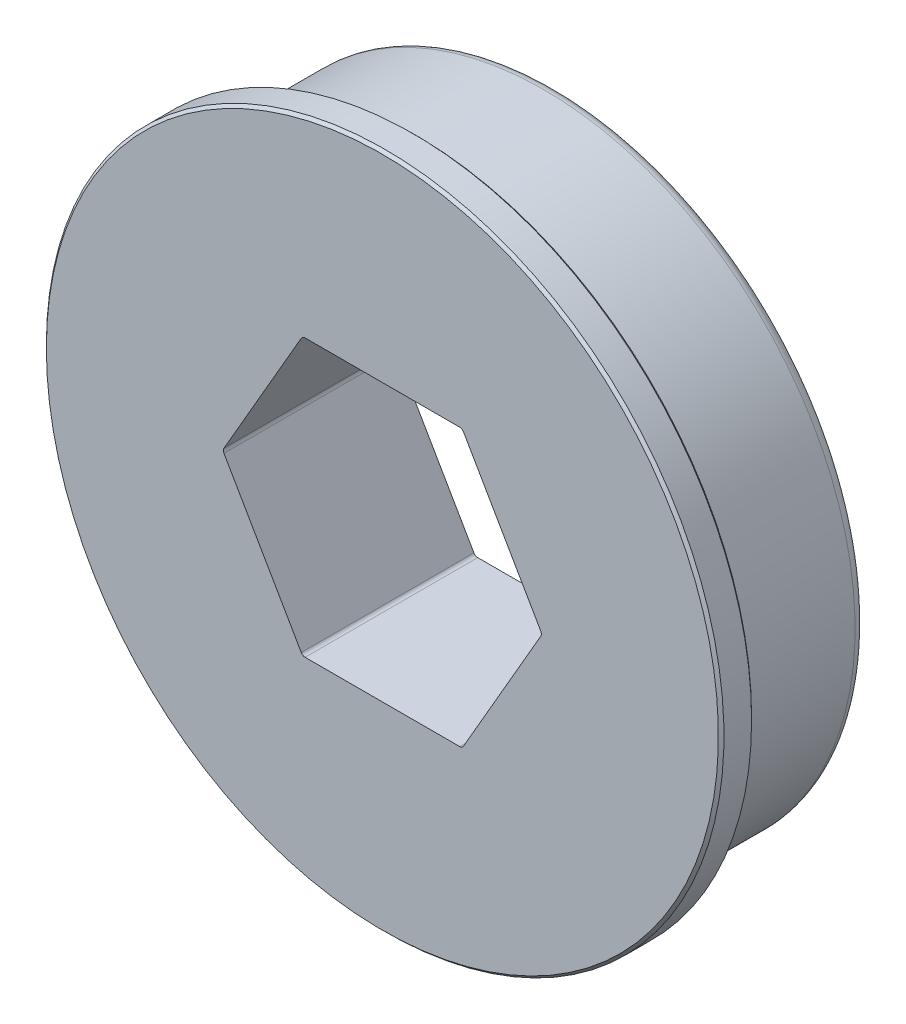
ISO-10303-21;
HEADER;
FILE_DESCRIPTION(('STEP AP214'),'2;1');
FILE_NAME('part.step','',(''),(''),'','','');
FILE_SCHEMA(('AUTOMOTIVE_DESIGN { 1 0 10303 214 1 1 1 1 }'));
ENDSEC;
DATA;
#1=APPLICATION_CONTEXT('core data for automotive mechanical design processes');
#2=APPLICATION_PROTOCOL_DEFINITION('international standard','automotive_design',2000,#1);
#3=PRODUCT_CONTEXT('',#1,'mechanical');
#4=PRODUCT('Part','Part','',(#3));
#5=PRODUCT_RELATED_PRODUCT_CATEGORY('part','',(#4));
#6=PRODUCT_DEFINITION_FORMATION('','',#4);
#7=PRODUCT_DEFINITION_CONTEXT('part definition',#1,'design');
#8=PRODUCT_DEFINITION('design','',#6,#7);
#9=PRODUCT_DEFINITION_SHAPE('','',#8);
#10=(LENGTH_UNIT() NAMED_UNIT(*) SI_UNIT(.MILLI.,.METRE.));
#11=(NAMED_UNIT(*) PLANE_ANGLE_UNIT() SI_UNIT($,.RADIAN.));
#12=(NAMED_UNIT(*) SI_UNIT($,.STERADIAN.) SOLID_ANGLE_UNIT());
#13=UNCERTAINTY_MEASURE_WITH_UNIT(LENGTH_MEASURE(1.E-05),#10,'distance_accuracy_value','');
#14=(GEOMETRIC_REPRESENTATION_CONTEXT(3) GLOBAL_UNCERTAINTY_ASSIGNED_CONTEXT((#13)) GLOBAL_UNIT_ASSIGNED_CONTEXT((#10,
#11,#12)) REPRESENTATION_CONTEXT('',''));
#15=CARTESIAN_POINT('',(0.,0.,0.));
#16=DIRECTION('',(0.,0.,1.));
#17=DIRECTION('',(1.,0.,0.));
#18=AXIS2_PLACEMENT_3D('',#15,#16,#17);
#19=CARTESIAN_POINT('',(0.,0.,7.92734));
#20=DIRECTION('',(0.,0.,-1.));
#21=DIRECTION('',(-1.,0.,0.));
#22=AXIS2_PLACEMENT_3D('',#19,#20,#21);
#23=CYLINDRICAL_SURFACE('',#22,13.97);
#24=CARTESIAN_POINT('',(0.,0.,6.40333999999999));
#25=DIRECTION('',(0.,0.,-1.));
#26=DIRECTION('',(-1.,0.,0.));
#27=AXIS2_PLACEMENT_3D('',#24,#25,#26);
#28=CIRCLE('',#27,13.97);
#29=CARTESIAN_POINT('',(-13.97,0.,6.40333999999999));
#30=VERTEX_POINT('',#29);
#31=EDGE_CURVE('E308',#30,#30,#28,.F.);
#32=ORIENTED_EDGE('',*,*,#31,.F.);
#33=EDGE_LOOP('',(#32));
#34=FACE_BOUND('',#33,.T.);
#35=CARTESIAN_POINT('',(0.,0.,5.89534));
#36=DIRECTION('',(0.,0.,-1.));
#37=DIRECTION('',(-1.,0.,0.));
#38=AXIS2_PLACEMENT_3D('',#35,#36,#37);
#39=CIRCLE('',#38,13.97);
#40=CARTESIAN_POINT('',(-13.97,0.,5.89534));
#41=VERTEX_POINT('',#40);
#42=EDGE_CURVE('E312',#41,#41,#39,.T.);
#43=ORIENTED_EDGE('',*,*,#42,.F.);
#44=EDGE_LOOP('',(#43));
#45=FACE_BOUND('',#44,.T.);
#46=ADVANCED_FACE('F16',(#34,#45),#23,.T.);
#47=CARTESIAN_POINT('',(14.2875,0.,5.89534));
#48=DIRECTION('',(0.,0.,1.));
#49=DIRECTION('',(1.,0.,0.));
#50=AXIS2_PLACEMENT_3D('',#47,#48,#49);
#51=PLANE('',#50);
#52=CARTESIAN_POINT('',(0.,0.,5.89534));
#53=DIRECTION('',(0.,0.,-1.));
#54=DIRECTION('',(-1.,0.,0.));
#55=AXIS2_PLACEMENT_3D('',#52,#53,#54);
#56=CIRCLE('',#55,14.2875);
#57=CARTESIAN_POINT('',(-14.2875,0.,5.89534));
#58=VERTEX_POINT('',#57);
#59=EDGE_CURVE('E304',#58,#58,#56,.T.);
#60=ORIENTED_EDGE('',*,*,#59,.F.);
#61=EDGE_LOOP('',(#60));
#62=FACE_BOUND('',#61,.T.);
#63=ORIENTED_EDGE('',*,*,#42,.T.);
#64=EDGE_LOOP('',(#63));
#65=FACE_BOUND('',#64,.T.);
#66=ADVANCED_FACE('F449',(#62,#65),#51,.T.);
#67=CARTESIAN_POINT('',(13.97,0.,6.40334));
#68=DIRECTION('',(0.,0.,-1.));
#69=DIRECTION('',(-1.,0.,0.));
#70=AXIS2_PLACEMENT_3D('',#67,#68,#69);
#71=PLANE('',#70);
#72=ORIENTED_EDGE('',*,*,#31,.T.);
#73=EDGE_LOOP('',(#72));
#74=FACE_BOUND('',#73,.T.);
#75=CARTESIAN_POINT('',(0.,0.,6.40334));
#76=DIRECTION('',(0.,0.,1.));
#77=DIRECTION('',(1.,0.,0.));
#78=AXIS2_PLACEMENT_3D('',#75,#76,#77);
#79=CIRCLE('',#78,15.4305);
#80=CARTESIAN_POINT('',(15.4305,0.,6.40334));
#81=VERTEX_POINT('',#80);
#82=EDGE_CURVE('E262',#81,#81,#79,.T.);
#83=ORIENTED_EDGE('',*,*,#82,.F.);
#84=EDGE_LOOP('',(#83));
#85=FACE_BOUND('',#84,.T.);
#86=ADVANCED_FACE('F447',(#74,#85),#71,.T.);
#87=CARTESIAN_POINT('',(0.,0.,7.92734));
#88=DIRECTION('',(0.,0.,-1.));
#89=DIRECTION('',(-1.,0.,0.));
#90=AXIS2_PLACEMENT_3D('',#87,#88,#89);
#91=CYLINDRICAL_SURFACE('',#90,14.2875);
#92=ORIENTED_EDGE('',*,*,#59,.T.);
#93=EDGE_LOOP('',(#92));
#94=FACE_BOUND('',#93,.T.);
#95=CARTESIAN_POINT('',(0.,0.,0.508));
#96=DIRECTION('',(0.,0.,-1.));
#97=DIRECTION('',(-1.,0.,0.));
#98=AXIS2_PLACEMENT_3D('',#95,#96,#97);
#99=CIRCLE('',#98,14.2875);
#100=CARTESIAN_POINT('',(-14.2875,0.,0.508));
#101=VERTEX_POINT('',#100);
#102=EDGE_CURVE('E258',#101,#101,#99,.T.);
#103=ORIENTED_EDGE('',*,*,#102,.F.);
#104=EDGE_LOOP('',(#103));
#105=FACE_BOUND('',#104,.T.);
#106=ADVANCED_FACE('F444',(#94,#105),#91,.T.);
#107=CARTESIAN_POINT('',(0.,0.,6.53034000000001));
#108=DIRECTION('',(0.,0.,1.));
#109=DIRECTION('',(1.,0.,0.));
#110=AXIS2_PLACEMENT_3D('',#107,#108,#109);
#111=CONICAL_SURFACE('',#110,15.5575,0.785398163397465);
#112=CARTESIAN_POINT('',(0.,0.,6.53034000000001));
#113=DIRECTION('',(0.,0.,-1.));
#114=DIRECTION('',(-1.,0.,0.));
#115=AXIS2_PLACEMENT_3D('',#112,#113,#114);
#116=CIRCLE('',#115,15.5575);
#117=CARTESIAN_POINT('',(-15.5575,0.,6.53034000000001));
#118=VERTEX_POINT('',#117);
#119=EDGE_CURVE('E98',#118,#118,#116,.F.);
#120=ORIENTED_EDGE('',*,*,#119,.F.);
#121=EDGE_LOOP('',(#120));
#122=FACE_BOUND('',#121,.T.);
#123=ORIENTED_EDGE('',*,*,#82,.T.);
#124=EDGE_LOOP('',(#123));
#125=FACE_BOUND('',#124,.T.);
#126=ADVANCED_FACE('F242',(#122,#125),#111,.T.);
#127=CARTESIAN_POINT('',(0.,0.,0.508));
#128=DIRECTION('',(0.,0.,-1.));
#129=DIRECTION('',(-1.,0.,0.));
#130=AXIS2_PLACEMENT_3D('',#127,#128,#129);
#131=TOROIDAL_SURFACE('',#130,13.7795,0.508);
#132=ORIENTED_EDGE('',*,*,#102,.T.);
#133=EDGE_LOOP('',(#132));
#134=FACE_BOUND('',#133,.T.);
#135=CARTESIAN_POINT('',(0.,0.,0.));
#136=DIRECTION('',(0.,0.,1.));
#137=DIRECTION('',(-1.,0.,0.));
#138=AXIS2_PLACEMENT_3D('',#135,#136,#137);
#139=CIRCLE('',#138,13.7795);
#140=CARTESIAN_POINT('',(13.7795,0.,0.));
#141=VERTEX_POINT('',#140);
#142=CARTESIAN_POINT('',(-13.7795,0.,0.));
#143=VERTEX_POINT('',#142);
#144=EDGE_CURVE('E290',#141,#143,#139,.F.);
#145=ORIENTED_EDGE('',*,*,#144,.F.);
#146=CARTESIAN_POINT('',(0.,0.,0.));
#147=DIRECTION('',(0.,0.,1.));
#148=DIRECTION('',(1.,0.,0.));
#149=AXIS2_PLACEMENT_3D('',#146,#147,#148);
#150=CIRCLE('',#149,13.7795);
#151=EDGE_CURVE('E184',#143,#141,#150,.F.);
#152=ORIENTED_EDGE('',*,*,#151,.F.);
#153=EDGE_LOOP('',(#145,#152));
#154=FACE_BOUND('',#153,.T.);
#155=ADVANCED_FACE('F236',(#134,#154),#131,.T.);
#156=CARTESIAN_POINT('',(0.,0.,7.92734));
#157=DIRECTION('',(0.,0.,-1.));
#158=DIRECTION('',(-1.,0.,0.));
#159=AXIS2_PLACEMENT_3D('',#156,#157,#158);
#160=CYLINDRICAL_SURFACE('',#159,15.5575);
#161=ORIENTED_EDGE('',*,*,#119,.T.);
#162=EDGE_LOOP('',(#161));
#163=FACE_BOUND('',#162,.T.);
#164=CARTESIAN_POINT('',(0.,0.,7.80034));
#165=DIRECTION('',(0.,0.,-1.));
#166=DIRECTION('',(-1.,0.,0.));
#167=AXIS2_PLACEMENT_3D('',#164,#165,#166);
#168=CIRCLE('',#167,15.5575);
#169=CARTESIAN_POINT('',(-15.5575,0.,7.80034));
#170=VERTEX_POINT('',#169);
#171=EDGE_CURVE('E174',#170,#170,#168,.F.);
#172=ORIENTED_EDGE('',*,*,#171,.F.);
#173=EDGE_LOOP('',(#172));
#174=FACE_BOUND('',#173,.T.);
#175=ADVANCED_FACE('F241',(#163,#174),#160,.T.);
#176=CARTESIAN_POINT('',(-7.09771326930958,0.,7.92734));
#177=DIRECTION('',(0.,0.,1.));
#178=DIRECTION('',(1.,0.,0.));
#179=AXIS2_PLACEMENT_3D('',#176,#177,#178);
#180=CYLINDRICAL_SURFACE('',#179,0.2032);
#181=DIRECTION('',(0.,0.,1.));
#182=VECTOR('',#181,1.);
#183=CARTESIAN_POINT('',(-7.27368963135858,-0.101600000000005,7.92734));
#184=LINE('',#183,#182);
#185=CARTESIAN_POINT('',(-7.27368963135857,-0.101600000000006,7.92734));
#186=VERTEX_POINT('',#185);
#187=CARTESIAN_POINT('',(-7.27368963135857,-0.101600000000005,0.));
#188=VERTEX_POINT('',#187);
#189=EDGE_CURVE('E171',#186,#188,#184,.F.);
#190=ORIENTED_EDGE('',*,*,#189,.T.);
#191=CARTESIAN_POINT('',(-7.09771326930958,0.,0.));
#192=DIRECTION('',(0.,0.,1.));
#193=DIRECTION('',(1.,0.,0.));
#194=AXIS2_PLACEMENT_3D('',#191,#192,#193);
#195=CIRCLE('',#194,0.2032);
#196=CARTESIAN_POINT('',(-7.27368963135857,0.101599999999994,0.));
#197=VERTEX_POINT('',#196);
#198=EDGE_CURVE('E106',#197,#188,#195,.T.);
#199=ORIENTED_EDGE('',*,*,#198,.F.);
#200=DIRECTION('',(0.,0.,1.));
#201=VECTOR('',#200,1.);
#202=CARTESIAN_POINT('',(-7.27368963135857,0.101599999999993,7.92734));
#203=LINE('',#202,#201);
#204=CARTESIAN_POINT('',(-7.27368963135857,0.101599999999994,7.92734));
#205=VERTEX_POINT('',#204);
#206=EDGE_CURVE('E102',#197,#205,#203,.T.);
#207=ORIENTED_EDGE('',*,*,#206,.T.);
#208=CARTESIAN_POINT('',(-7.09771326930958,0.,7.92734));
#209=DIRECTION('',(0.,0.,1.));
#210=DIRECTION('',(1.,0.,0.));
#211=AXIS2_PLACEMENT_3D('',#208,#209,#210);
#212=CIRCLE('',#211,0.2032);
#213=EDGE_CURVE('E85',#186,#205,#212,.F.);
#214=ORIENTED_EDGE('',*,*,#213,.F.);
#215=EDGE_LOOP('',(#190,#199,#207,#214));
#216=FACE_BOUND('',#215,.T.);
#217=ADVANCED_FACE('F103',(#216),#180,.F.);
#218=CARTESIAN_POINT('',(-3.54885663465479,6.14679999999999,7.92734));
#219=DIRECTION('',(0.,0.,1.));
#220=DIRECTION('',(1.,0.,0.));
#221=AXIS2_PLACEMENT_3D('',#218,#219,#220);
#222=CYLINDRICAL_SURFACE('',#221,0.2032);
#223=DIRECTION('',(0.,0.,1.));
#224=VECTOR('',#223,1.);
#225=CARTESIAN_POINT('',(-3.72483299670379,6.24839999999999,7.92734));
#226=LINE('',#225,#224);
#227=CARTESIAN_POINT('',(-3.72483299670379,6.24839999999999,7.92734));
#228=VERTEX_POINT('',#227);
#229=CARTESIAN_POINT('',(-3.72483299670378,6.24839999999999,0.));
#230=VERTEX_POINT('',#229);
#231=EDGE_CURVE('E117',#228,#230,#226,.F.);
#232=ORIENTED_EDGE('',*,*,#231,.T.);
#233=CARTESIAN_POINT('',(-3.54885663465479,6.14679999999999,0.));
#234=DIRECTION('',(0.,0.,1.));
#235=DIRECTION('',(1.,0.,0.));
#236=AXIS2_PLACEMENT_3D('',#233,#234,#235);
#237=CIRCLE('',#236,0.2032);
#238=CARTESIAN_POINT('',(-3.54885663465479,6.34999999999999,0.));
#239=VERTEX_POINT('',#238);
#240=EDGE_CURVE('E272',#239,#230,#237,.T.);
#241=ORIENTED_EDGE('',*,*,#240,.F.);
#242=DIRECTION('',(0.,0.,1.));
#243=VECTOR('',#242,1.);
#244=CARTESIAN_POINT('',(-3.54885663465479,6.34999999999999,7.92734));
#245=LINE('',#244,#243);
#246=CARTESIAN_POINT('',(-3.54885663465479,6.34999999999999,7.92734));
#247=VERTEX_POINT('',#246);
#248=EDGE_CURVE('E111',#239,#247,#245,.T.);
#249=ORIENTED_EDGE('',*,*,#248,.T.);
#250=CARTESIAN_POINT('',(-3.54885663465479,6.14679999999999,7.92734));
#251=DIRECTION('',(0.,0.,1.));
#252=DIRECTION('',(1.,0.,0.));
#253=AXIS2_PLACEMENT_3D('',#250,#251,#252);
#254=CIRCLE('',#253,0.2032);
#255=EDGE_CURVE('E97',#228,#247,#254,.F.);
#256=ORIENTED_EDGE('',*,*,#255,.F.);
#257=EDGE_LOOP('',(#232,#241,#249,#256));
#258=FACE_BOUND('',#257,.T.);
#259=ADVANCED_FACE('F387',(#258),#222,.F.);
#260=CARTESIAN_POINT('',(3.5488566346548,6.1468,7.92734));
#261=DIRECTION('',(0.,0.,1.));
#262=DIRECTION('',(1.,0.,0.));
#263=AXIS2_PLACEMENT_3D('',#260,#261,#262);
#264=CYLINDRICAL_SURFACE('',#263,0.2032);
#265=DIRECTION('',(0.,0.,1.));
#266=VECTOR('',#265,1.);
#267=CARTESIAN_POINT('',(3.5488566346548,6.35,7.92734));
#268=LINE('',#267,#266);
#269=CARTESIAN_POINT('',(3.5488566346548,6.34999999999999,7.92734));
#270=VERTEX_POINT('',#269);
#271=CARTESIAN_POINT('',(3.5488566346548,6.35,0.));
#272=VERTEX_POINT('',#271);
#273=EDGE_CURVE('E162',#270,#272,#268,.F.);
#274=ORIENTED_EDGE('',*,*,#273,.T.);
#275=CARTESIAN_POINT('',(3.5488566346548,6.1468,0.));
#276=DIRECTION('',(0.,0.,1.));
#277=DIRECTION('',(1.,0.,0.));
#278=AXIS2_PLACEMENT_3D('',#275,#276,#277);
#279=CIRCLE('',#278,0.2032);
#280=CARTESIAN_POINT('',(3.7248329967038,6.2484,0.));
#281=VERTEX_POINT('',#280);
#282=EDGE_CURVE('E276',#281,#272,#279,.T.);
#283=ORIENTED_EDGE('',*,*,#282,.F.);
#284=DIRECTION('',(0.,0.,1.));
#285=VECTOR('',#284,1.);
#286=CARTESIAN_POINT('',(3.72483299670379,6.2484,7.92734));
#287=LINE('',#286,#285);
#288=CARTESIAN_POINT('',(3.72483299670379,6.2484,7.92734));
#289=VERTEX_POINT('',#288);
#290=EDGE_CURVE('E149',#281,#289,#287,.T.);
#291=ORIENTED_EDGE('',*,*,#290,.T.);
#292=CARTESIAN_POINT('',(3.5488566346548,6.1468,7.92734));
#293=DIRECTION('',(0.,0.,1.));
#294=DIRECTION('',(1.,0.,0.));
#295=AXIS2_PLACEMENT_3D('',#292,#293,#294);
#296=CIRCLE('',#295,0.2032);
#297=EDGE_CURVE('E296',#270,#289,#296,.F.);
#298=ORIENTED_EDGE('',*,*,#297,.F.);
#299=EDGE_LOOP('',(#274,#283,#291,#298));
#300=FACE_BOUND('',#299,.T.);
#301=ADVANCED_FACE('F393',(#300),#264,.F.);
#302=CARTESIAN_POINT('',(7.09771326930959,0.,7.92734));
#303=DIRECTION('',(0.,0.,1.));
#304=DIRECTION('',(1.,0.,0.));
#305=AXIS2_PLACEMENT_3D('',#302,#303,#304);
#306=CYLINDRICAL_SURFACE('',#305,0.2032);
#307=CARTESIAN_POINT('',(7.09771326930959,0.,0.));
#308=DIRECTION('',(0.,0.,1.));
#309=DIRECTION('',(1.,0.,0.));
#310=AXIS2_PLACEMENT_3D('',#307,#308,#309);
#311=CIRCLE('',#310,0.2032);
#312=CARTESIAN_POINT('',(7.27368963135859,-0.101600000000005,0.));
#313=VERTEX_POINT('',#312);
#314=CARTESIAN_POINT('',(7.27368963135859,0.101599999999995,0.));
#315=VERTEX_POINT('',#314);
#316=EDGE_CURVE('E280',#313,#315,#311,.T.);
#317=ORIENTED_EDGE('',*,*,#316,.F.);
#318=DIRECTION('',(0.,0.,1.));
#319=VECTOR('',#318,1.);
#320=CARTESIAN_POINT('',(7.27368963135859,-0.101600000000005,7.92734));
#321=LINE('',#320,#319);
#322=CARTESIAN_POINT('',(7.27368963135859,-0.101600000000005,7.92734));
#323=VERTEX_POINT('',#322);
#324=EDGE_CURVE('E140',#313,#323,#321,.T.);
#325=ORIENTED_EDGE('',*,*,#324,.T.);
#326=CARTESIAN_POINT('',(7.09771326930959,0.,7.92734));
#327=DIRECTION('',(0.,0.,1.));
#328=DIRECTION('',(1.,0.,0.));
#329=AXIS2_PLACEMENT_3D('',#326,#327,#328);
#330=CIRCLE('',#329,0.2032);
#331=CARTESIAN_POINT('',(7.27368963135859,0.101599999999995,7.92734));
#332=VERTEX_POINT('',#331);
#333=EDGE_CURVE('E293',#332,#323,#330,.F.);
#334=ORIENTED_EDGE('',*,*,#333,.F.);
#335=DIRECTION('',(0.,0.,1.));
#336=VECTOR('',#335,1.);
#337=CARTESIAN_POINT('',(7.27368963135859,0.101599999999995,7.92734));
#338=LINE('',#337,#336);
#339=EDGE_CURVE('E154',#332,#315,#338,.F.);
#340=ORIENTED_EDGE('',*,*,#339,.T.);
#341=EDGE_LOOP('',(#317,#325,#334,#340));
#342=FACE_BOUND('',#341,.T.);
#343=ADVANCED_FACE('F401',(#342),#306,.F.);
#344=CARTESIAN_POINT('',(-3.54885663465478,-6.14680000000001,7.92734));
#345=DIRECTION('',(0.,0.,1.));
#346=DIRECTION('',(1.,0.,0.));
#347=AXIS2_PLACEMENT_3D('',#344,#345,#346);
#348=CYLINDRICAL_SURFACE('',#347,0.2032);
#349=DIRECTION('',(0.,0.,-1.));
#350=VECTOR('',#349,1.);
#351=CARTESIAN_POINT('',(-3.54885663465478,-6.35000000000001,7.92734));
#352=LINE('',#351,#350);
#353=CARTESIAN_POINT('',(-3.54885663465478,-6.35000000000001,7.92734));
#354=VERTEX_POINT('',#353);
#355=CARTESIAN_POINT('',(-3.54885663465478,-6.35000000000001,0.));
#356=VERTEX_POINT('',#355);
#357=EDGE_CURVE('E137',#354,#356,#352,.T.);
#358=ORIENTED_EDGE('',*,*,#357,.T.);
#359=CARTESIAN_POINT('',(-3.54885663465478,-6.14680000000001,0.));
#360=DIRECTION('',(0.,0.,1.));
#361=DIRECTION('',(1.,0.,0.));
#362=AXIS2_PLACEMENT_3D('',#359,#360,#361);
#363=CIRCLE('',#362,0.2032);
#364=CARTESIAN_POINT('',(-3.72483299670378,-6.24840000000001,0.));
#365=VERTEX_POINT('',#364);
#366=EDGE_CURVE('E284',#365,#356,#363,.T.);
#367=ORIENTED_EDGE('',*,*,#366,.F.);
#368=DIRECTION('',(0.,0.,1.));
#369=VECTOR('',#368,1.);
#370=CARTESIAN_POINT('',(-3.72483299670378,-6.24840000000001,7.92734));
#371=LINE('',#370,#369);
#372=CARTESIAN_POINT('',(-3.72483299670378,-6.24840000000001,7.92734));
#373=VERTEX_POINT('',#372);
#374=EDGE_CURVE('E167',#365,#373,#371,.T.);
#375=ORIENTED_EDGE('',*,*,#374,.T.);
#376=CARTESIAN_POINT('',(-3.54885663465478,-6.14680000000001,7.92734));
#377=DIRECTION('',(0.,0.,1.));
#378=DIRECTION('',(1.,0.,0.));
#379=AXIS2_PLACEMENT_3D('',#376,#377,#378);
#380=CIRCLE('',#379,0.2032);
#381=EDGE_CURVE('E41',#354,#373,#380,.F.);
#382=ORIENTED_EDGE('',*,*,#381,.F.);
#383=EDGE_LOOP('',(#358,#367,#375,#382));
#384=FACE_BOUND('',#383,.T.);
#385=ADVANCED_FACE('F201',(#384),#348,.F.);
#386=CARTESIAN_POINT('',(0.,0.,0.));
#387=DIRECTION('',(0.,0.,-1.));
#388=DIRECTION('',(-1.,0.,0.));
#389=AXIS2_PLACEMENT_3D('',#386,#387,#388);
#390=PLANE('',#389);
#391=DIRECTION('',(-1.,0.,0.));
#392=VECTOR('',#391,1.);
#393=CARTESIAN_POINT('',(-3.66617420935412,6.34999999999999,0.));
#394=LINE('',#393,#392);
#395=EDGE_CURVE('E158',#272,#239,#394,.T.);
#396=ORIENTED_EDGE('',*,*,#395,.T.);
#397=ORIENTED_EDGE('',*,*,#240,.T.);
#398=DIRECTION('',(-0.5,-0.866025403784439,0.));
#399=VECTOR('',#398,1.);
#400=CARTESIAN_POINT('',(-7.33234841870824,0.,0.));
#401=LINE('',#400,#399);
#402=EDGE_CURVE('E112',#230,#197,#401,.T.);
#403=ORIENTED_EDGE('',*,*,#402,.T.);
#404=ORIENTED_EDGE('',*,*,#198,.T.);
#405=DIRECTION('',(0.5,-0.866025403784439,0.));
#406=VECTOR('',#405,1.);
#407=CARTESIAN_POINT('',(-3.66617420935411,-6.35000000000001,0.));
#408=LINE('',#407,#406);
#409=EDGE_CURVE('E170',#188,#365,#408,.T.);
#410=ORIENTED_EDGE('',*,*,#409,.T.);
#411=ORIENTED_EDGE('',*,*,#366,.T.);
#412=DIRECTION('',(1.,0.,0.));
#413=VECTOR('',#412,1.);
#414=CARTESIAN_POINT('',(3.66617420935413,-6.35000000000001,0.));
#415=LINE('',#414,#413);
#416=CARTESIAN_POINT('',(3.5488566346548,-6.35000000000001,0.));
#417=VERTEX_POINT('',#416);
#418=EDGE_CURVE('E136',#356,#417,#415,.T.);
#419=ORIENTED_EDGE('',*,*,#418,.T.);
#420=CARTESIAN_POINT('',(3.5488566346548,-6.14680000000001,0.));
#421=DIRECTION('',(0.,0.,1.));
#422=DIRECTION('',(1.,0.,0.));
#423=AXIS2_PLACEMENT_3D('',#420,#421,#422);
#424=CIRCLE('',#423,0.2032);
#425=CARTESIAN_POINT('',(3.7248329967038,-6.24840000000001,0.));
#426=VERTEX_POINT('',#425);
#427=EDGE_CURVE('E268',#417,#426,#424,.T.);
#428=ORIENTED_EDGE('',*,*,#427,.T.);
#429=DIRECTION('',(0.5,0.866025403784439,0.));
#430=VECTOR('',#429,1.);
#431=CARTESIAN_POINT('',(7.33234841870825,0.,0.));
#432=LINE('',#431,#430);
#433=EDGE_CURVE('E144',#426,#313,#432,.T.);
#434=ORIENTED_EDGE('',*,*,#433,.T.);
#435=ORIENTED_EDGE('',*,*,#316,.T.);
#436=DIRECTION('',(-0.5,0.866025403784439,0.));
#437=VECTOR('',#436,1.);
#438=CARTESIAN_POINT('',(3.66617420935413,6.35,0.));
#439=LINE('',#438,#437);
#440=EDGE_CURVE('E153',#315,#281,#439,.T.);
#441=ORIENTED_EDGE('',*,*,#440,.T.);
#442=ORIENTED_EDGE('',*,*,#282,.T.);
#443=EDGE_LOOP('',(#396,#397,#403,#404,#410,#411,#419,#428,#434,#435,#441,#442));
#444=FACE_BOUND('',#443,.T.);
#445=ORIENTED_EDGE('',*,*,#151,.T.);
#446=ORIENTED_EDGE('',*,*,#144,.T.);
#447=EDGE_LOOP('',(#445,#446));
#448=FACE_BOUND('',#447,.T.);
#449=ADVANCED_FACE('F190',(#444,#448),#390,.T.);
#450=CARTESIAN_POINT('',(3.5488566346548,-6.14680000000001,7.92734));
#451=DIRECTION('',(0.,0.,1.));
#452=DIRECTION('',(1.,0.,0.));
#453=AXIS2_PLACEMENT_3D('',#450,#451,#452);
#454=CYLINDRICAL_SURFACE('',#453,0.2032);
#455=DIRECTION('',(0.,0.,1.));
#456=VECTOR('',#455,1.);
#457=CARTESIAN_POINT('',(3.7248329967038,-6.2484,7.92734));
#458=LINE('',#457,#456);
#459=CARTESIAN_POINT('',(3.7248329967038,-6.2484,7.92734));
#460=VERTEX_POINT('',#459);
#461=EDGE_CURVE('E145',#460,#426,#458,.F.);
#462=ORIENTED_EDGE('',*,*,#461,.T.);
#463=ORIENTED_EDGE('',*,*,#427,.F.);
#464=DIRECTION('',(0.,0.,-1.));
#465=VECTOR('',#464,1.);
#466=CARTESIAN_POINT('',(3.5488566346548,-6.35000000000001,7.92734));
#467=LINE('',#466,#465);
#468=CARTESIAN_POINT('',(3.5488566346548,-6.35000000000001,7.92734));
#469=VERTEX_POINT('',#468);
#470=EDGE_CURVE('E133',#417,#469,#467,.F.);
#471=ORIENTED_EDGE('',*,*,#470,.T.);
#472=CARTESIAN_POINT('',(3.5488566346548,-6.14680000000001,7.92734));
#473=DIRECTION('',(0.,0.,1.));
#474=DIRECTION('',(1.,0.,0.));
#475=AXIS2_PLACEMENT_3D('',#472,#473,#474);
#476=CIRCLE('',#475,0.2032);
#477=EDGE_CURVE('E231',#460,#469,#476,.F.);
#478=ORIENTED_EDGE('',*,*,#477,.F.);
#479=EDGE_LOOP('',(#462,#463,#471,#478));
#480=FACE_BOUND('',#479,.T.);
#481=ADVANCED_FACE('F200',(#480),#454,.F.);
#482=CARTESIAN_POINT('',(0.,0.,7.80034));
#483=DIRECTION('',(0.,0.,-1.));
#484=DIRECTION('',(-1.,0.,0.));
#485=AXIS2_PLACEMENT_3D('',#482,#483,#484);
#486=CONICAL_SURFACE('',#485,15.5575,0.785398163397442);
#487=ORIENTED_EDGE('',*,*,#171,.T.);
#488=EDGE_LOOP('',(#487));
#489=FACE_BOUND('',#488,.T.);
#490=CARTESIAN_POINT('',(0.,0.,7.92734));
#491=DIRECTION('',(0.,0.,-1.));
#492=DIRECTION('',(-1.,0.,0.));
#493=AXIS2_PLACEMENT_3D('',#490,#491,#492);
#494=CIRCLE('',#493,15.4305);
#495=CARTESIAN_POINT('',(-15.4305,0.,7.92734));
#496=VERTEX_POINT('',#495);
#497=EDGE_CURVE('E129',#496,#496,#494,.F.);
#498=ORIENTED_EDGE('',*,*,#497,.F.);
#499=EDGE_LOOP('',(#498));
#500=FACE_BOUND('',#499,.T.);
#501=ADVANCED_FACE('F425',(#489,#500),#486,.T.);
#502=CARTESIAN_POINT('',(-3.66617420935411,-6.35000000000001,7.92734));
#503=DIRECTION('',(-0.866025403784439,-0.5,0.));
#504=DIRECTION('',(0.5,-0.866025403784439,0.));
#505=AXIS2_PLACEMENT_3D('',#502,#503,#504);
#506=PLANE('',#505);
#507=ORIENTED_EDGE('',*,*,#374,.F.);
#508=ORIENTED_EDGE('',*,*,#409,.F.);
#509=ORIENTED_EDGE('',*,*,#189,.F.);
#510=DIRECTION('',(-0.5,0.866025403784438,0.));
#511=VECTOR('',#510,1.);
#512=CARTESIAN_POINT('',(-3.72483299670378,-6.24840000000001,7.92734));
#513=LINE('',#512,#511);
#514=EDGE_CURVE('E95',#373,#186,#513,.T.);
#515=ORIENTED_EDGE('',*,*,#514,.F.);
#516=EDGE_LOOP('',(#507,#508,#509,#515));
#517=FACE_BOUND('',#516,.T.);
#518=ADVANCED_FACE('F383',(#517),#506,.F.);
#519=CARTESIAN_POINT('',(-7.33234841870824,0.,7.92734));
#520=DIRECTION('',(-0.866025403784439,0.5,0.));
#521=DIRECTION('',(-0.5,-0.866025403784439,0.));
#522=AXIS2_PLACEMENT_3D('',#519,#520,#521);
#523=PLANE('',#522);
#524=ORIENTED_EDGE('',*,*,#206,.F.);
#525=ORIENTED_EDGE('',*,*,#402,.F.);
#526=ORIENTED_EDGE('',*,*,#231,.F.);
#527=DIRECTION('',(0.5,0.866025403784439,0.));
#528=VECTOR('',#527,1.);
#529=CARTESIAN_POINT('',(-7.27368963135857,0.101599999999993,7.92734));
#530=LINE('',#529,#528);
#531=EDGE_CURVE('E93',#205,#228,#530,.T.);
#532=ORIENTED_EDGE('',*,*,#531,.F.);
#533=EDGE_LOOP('',(#524,#525,#526,#532));
#534=FACE_BOUND('',#533,.T.);
#535=ADVANCED_FACE('F115',(#534),#523,.F.);
#536=CARTESIAN_POINT('',(-3.66617420935412,6.34999999999999,7.92734));
#537=DIRECTION('',(0.,1.,0.));
#538=DIRECTION('',(-1.,0.,0.));
#539=AXIS2_PLACEMENT_3D('',#536,#537,#538);
#540=PLANE('',#539);
#541=ORIENTED_EDGE('',*,*,#273,.F.);
#542=DIRECTION('',(1.,0.,0.));
#543=VECTOR('',#542,1.);
#544=CARTESIAN_POINT('',(15.5575,6.34999999999999,7.92734));
#545=LINE('',#544,#543);
#546=EDGE_CURVE('E119',#247,#270,#545,.T.);
#547=ORIENTED_EDGE('',*,*,#546,.F.);
#548=ORIENTED_EDGE('',*,*,#248,.F.);
#549=ORIENTED_EDGE('',*,*,#395,.F.);
#550=EDGE_LOOP('',(#541,#547,#548,#549));
#551=FACE_BOUND('',#550,.T.);
#552=ADVANCED_FACE('F391',(#551),#540,.F.);
#553=CARTESIAN_POINT('',(3.66617420935413,6.35,7.92734));
#554=DIRECTION('',(0.866025403784439,0.5,0.));
#555=DIRECTION('',(-0.5,0.866025403784439,0.));
#556=AXIS2_PLACEMENT_3D('',#553,#554,#555);
#557=PLANE('',#556);
#558=ORIENTED_EDGE('',*,*,#290,.F.);
#559=ORIENTED_EDGE('',*,*,#440,.F.);
#560=ORIENTED_EDGE('',*,*,#339,.F.);
#561=DIRECTION('',(0.5,-0.866025403784438,0.));
#562=VECTOR('',#561,1.);
#563=CARTESIAN_POINT('',(3.72483299670379,6.2484,7.92734));
#564=LINE('',#563,#562);
#565=EDGE_CURVE('E126',#289,#332,#564,.T.);
#566=ORIENTED_EDGE('',*,*,#565,.F.);
#567=EDGE_LOOP('',(#558,#559,#560,#566));
#568=FACE_BOUND('',#567,.T.);
#569=ADVANCED_FACE('F399',(#568),#557,.F.);
#570=CARTESIAN_POINT('',(7.33234841870825,0.,7.92734));
#571=DIRECTION('',(0.866025403784439,-0.5,0.));
#572=DIRECTION('',(0.5,0.866025403784439,0.));
#573=AXIS2_PLACEMENT_3D('',#570,#571,#572);
#574=PLANE('',#573);
#575=ORIENTED_EDGE('',*,*,#324,.F.);
#576=ORIENTED_EDGE('',*,*,#433,.F.);
#577=ORIENTED_EDGE('',*,*,#461,.F.);
#578=DIRECTION('',(-0.5,-0.866025403784439,0.));
#579=VECTOR('',#578,1.);
#580=CARTESIAN_POINT('',(7.27368963135859,-0.101600000000005,7.92734));
#581=LINE('',#580,#579);
#582=EDGE_CURVE('E28',#323,#460,#581,.T.);
#583=ORIENTED_EDGE('',*,*,#582,.F.);
#584=EDGE_LOOP('',(#575,#576,#577,#583));
#585=FACE_BOUND('',#584,.T.);
#586=ADVANCED_FACE('F334',(#585),#574,.F.);
#587=CARTESIAN_POINT('',(3.66617420935413,-6.35000000000001,7.92734));
#588=DIRECTION('',(0.,-1.,0.));
#589=DIRECTION('',(0.,0.,-1.));
#590=AXIS2_PLACEMENT_3D('',#587,#588,#589);
#591=PLANE('',#590);
#592=ORIENTED_EDGE('',*,*,#470,.F.);
#593=ORIENTED_EDGE('',*,*,#418,.F.);
#594=ORIENTED_EDGE('',*,*,#357,.F.);
#595=DIRECTION('',(1.,0.,0.));
#596=VECTOR('',#595,1.);
#597=CARTESIAN_POINT('',(15.5575,-6.35000000000001,7.92734));
#598=LINE('',#597,#596);
#599=EDGE_CURVE('E11',#469,#354,#598,.F.);
#600=ORIENTED_EDGE('',*,*,#599,.F.);
#601=EDGE_LOOP('',(#592,#593,#594,#600));
#602=FACE_BOUND('',#601,.T.);
#603=ADVANCED_FACE('F378',(#602),#591,.F.);
#604=CARTESIAN_POINT('',(15.5575,0.,7.92734));
#605=DIRECTION('',(0.,0.,1.));
#606=DIRECTION('',(1.,0.,0.));
#607=AXIS2_PLACEMENT_3D('',#604,#605,#606);
#608=PLANE('',#607);
#609=ORIENTED_EDGE('',*,*,#599,.T.);
#610=ORIENTED_EDGE('',*,*,#381,.T.);
#611=ORIENTED_EDGE('',*,*,#514,.T.);
#612=ORIENTED_EDGE('',*,*,#213,.T.);
#613=ORIENTED_EDGE('',*,*,#531,.T.);
#614=ORIENTED_EDGE('',*,*,#255,.T.);
#615=ORIENTED_EDGE('',*,*,#546,.T.);
#616=ORIENTED_EDGE('',*,*,#297,.T.);
#617=ORIENTED_EDGE('',*,*,#565,.T.);
#618=ORIENTED_EDGE('',*,*,#333,.T.);
#619=ORIENTED_EDGE('',*,*,#582,.T.);
#620=ORIENTED_EDGE('',*,*,#477,.T.);
#621=EDGE_LOOP('',(#609,#610,#611,#612,#613,#614,#615,#616,#617,#618,#619,#620));
#622=FACE_BOUND('',#621,.T.);
#623=ORIENTED_EDGE('',*,*,#497,.T.);
#624=EDGE_LOOP('',(#623));
#625=FACE_BOUND('',#624,.T.);
#626=ADVANCED_FACE('F90',(#622,#625),#608,.T.);
#627=CLOSED_SHELL('',(#46,#66,#86,#106,#126,#155,#175,#217,#259,#301,#343,#385,#449,#481,#501,
#518,#535,#552,#569,#586,#603,#626));
#628=MANIFOLD_SOLID_BREP('B1',#627);
#629=ADVANCED_BREP_SHAPE_REPRESENTATION('',(#18,#628),#14);
#630=SHAPE_DEFINITION_REPRESENTATION(#9,#629);
ENDSEC;
END-ISO-10303-21;
